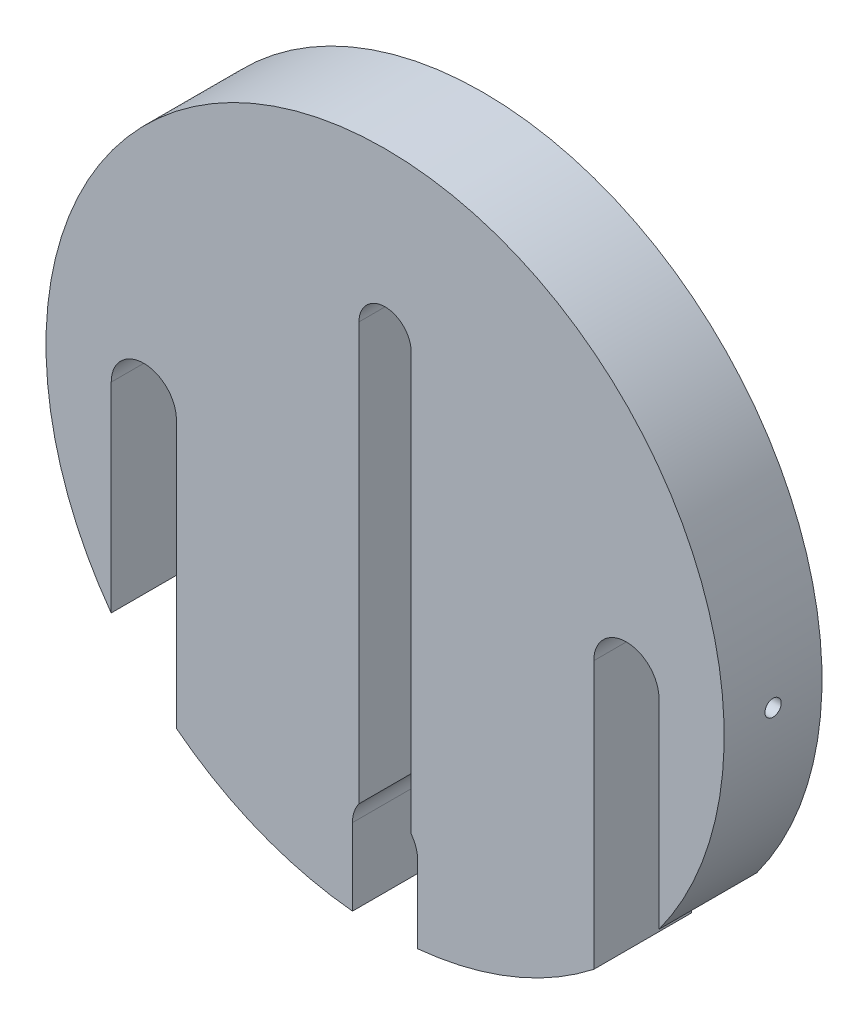
ISO-10303-21;
HEADER;
FILE_DESCRIPTION(('STEP AP214'),'2;1');
FILE_NAME('part.step','',(''),(''),'','','');
FILE_SCHEMA(('AUTOMOTIVE_DESIGN { 1 0 10303 214 1 1 1 1 }'));
ENDSEC;
DATA;
#1=APPLICATION_CONTEXT('core data for automotive mechanical design processes');
#2=APPLICATION_PROTOCOL_DEFINITION('international standard','automotive_design',2000,#1);
#3=PRODUCT_CONTEXT('',#1,'mechanical');
#4=PRODUCT('Part','Part','',(#3));
#5=PRODUCT_RELATED_PRODUCT_CATEGORY('part','',(#4));
#6=PRODUCT_DEFINITION_FORMATION('','',#4);
#7=PRODUCT_DEFINITION_CONTEXT('part definition',#1,'design');
#8=PRODUCT_DEFINITION('design','',#6,#7);
#9=PRODUCT_DEFINITION_SHAPE('','',#8);
#10=(LENGTH_UNIT() NAMED_UNIT(*) SI_UNIT(.MILLI.,.METRE.));
#11=(NAMED_UNIT(*) PLANE_ANGLE_UNIT() SI_UNIT($,.RADIAN.));
#12=(NAMED_UNIT(*) SI_UNIT($,.STERADIAN.) SOLID_ANGLE_UNIT());
#13=UNCERTAINTY_MEASURE_WITH_UNIT(LENGTH_MEASURE(1.E-05),#10,'distance_accuracy_value','');
#14=(GEOMETRIC_REPRESENTATION_CONTEXT(3) GLOBAL_UNCERTAINTY_ASSIGNED_CONTEXT((#13)) GLOBAL_UNIT_ASSIGNED_CONTEXT((#10,
#11,#12)) REPRESENTATION_CONTEXT('',''));
#15=CARTESIAN_POINT('',(0.,0.,0.));
#16=DIRECTION('',(0.,0.,1.));
#17=DIRECTION('',(1.,0.,0.));
#18=AXIS2_PLACEMENT_3D('',#15,#16,#17);
#19=CARTESIAN_POINT('',(0.,0.,15.));
#20=DIRECTION('',(0.,0.,1.));
#21=DIRECTION('',(1.,0.,0.));
#22=AXIS2_PLACEMENT_3D('',#19,#20,#21);
#23=PLANE('',#22);
#24=CARTESIAN_POINT('',(0.,27.,15.));
#25=DIRECTION('',(0.,0.,-1.));
#26=DIRECTION('',(-1.,0.,0.));
#27=AXIS2_PLACEMENT_3D('',#24,#25,#26);
#28=CIRCLE('',#27,4.00000000000005);
#29=CARTESIAN_POINT('',(-4.00000000000004,27.,15.));
#30=VERTEX_POINT('',#29);
#31=CARTESIAN_POINT('',(4.,27.000000608153,15.));
#32=VERTEX_POINT('',#31);
#33=EDGE_CURVE('E411',#30,#32,#28,.T.);
#34=ORIENTED_EDGE('',*,*,#33,.T.);
#35=DIRECTION('',(0.,-1.,0.));
#36=VECTOR('',#35,1.);
#37=CARTESIAN_POINT('',(4.,27.000000608153,15.));
#38=LINE('',#37,#36);
#39=CARTESIAN_POINT('',(4.00000000000001,-37.,15.));
#40=VERTEX_POINT('',#39);
#41=EDGE_CURVE('E410',#32,#40,#38,.T.);
#42=ORIENTED_EDGE('',*,*,#41,.T.);
#43=CARTESIAN_POINT('',(0.,-40.,15.));
#44=DIRECTION('',(0.,0.,1.));
#45=DIRECTION('',(1.,0.,0.));
#46=AXIS2_PLACEMENT_3D('',#43,#44,#45);
#47=CIRCLE('',#46,5.00000000000001);
#48=CARTESIAN_POINT('',(5.00000000000001,-40.,15.));
#49=VERTEX_POINT('',#48);
#50=EDGE_CURVE('E221',#49,#40,#47,.T.);
#51=ORIENTED_EDGE('',*,*,#50,.F.);
#52=DIRECTION('',(0.,1.,0.));
#53=VECTOR('',#52,1.);
#54=CARTESIAN_POINT('',(5.00000000000001,-40.,15.));
#55=LINE('',#54,#53);
#56=CARTESIAN_POINT('',(5.,-51.7590571784301,15.));
#57=VERTEX_POINT('',#56);
#58=EDGE_CURVE('E217',#57,#49,#55,.T.);
#59=ORIENTED_EDGE('',*,*,#58,.F.);
#60=CARTESIAN_POINT('',(0.,0.,15.));
#61=DIRECTION('',(0.,0.,1.));
#62=DIRECTION('',(1.,0.,0.));
#63=AXIS2_PLACEMENT_3D('',#60,#61,#62);
#64=CIRCLE('',#63,52.);
#65=CARTESIAN_POINT('',(32.,-40.9878030638384,15.));
#66=VERTEX_POINT('',#65);
#67=EDGE_CURVE('E251',#57,#66,#64,.T.);
#68=ORIENTED_EDGE('',*,*,#67,.T.);
#69=DIRECTION('',(0.,-1.,0.));
#70=VECTOR('',#69,1.);
#71=CARTESIAN_POINT('',(32.,0.,15.));
#72=LINE('',#71,#70);
#73=CARTESIAN_POINT('',(32.,0.,15.));
#74=VERTEX_POINT('',#73);
#75=EDGE_CURVE('E383',#74,#66,#72,.T.);
#76=ORIENTED_EDGE('',*,*,#75,.F.);
#77=CARTESIAN_POINT('',(37.,0.,15.));
#78=DIRECTION('',(0.,0.,1.));
#79=DIRECTION('',(-1.,0.,0.));
#80=AXIS2_PLACEMENT_3D('',#77,#78,#79);
#81=CIRCLE('',#80,5.00000000000001);
#82=CARTESIAN_POINT('',(42.,3.54103706807145E-07,15.));
#83=VERTEX_POINT('',#82);
#84=EDGE_CURVE('E388',#83,#74,#81,.T.);
#85=ORIENTED_EDGE('',*,*,#84,.F.);
#86=DIRECTION('',(0.,1.,0.));
#87=VECTOR('',#86,1.);
#88=CARTESIAN_POINT('',(42.,3.54103707564824E-07,15.));
#89=LINE('',#88,#87);
#90=CARTESIAN_POINT('',(42.,-30.6594194335118,15.));
#91=VERTEX_POINT('',#90);
#92=EDGE_CURVE('E205',#91,#83,#89,.T.);
#93=ORIENTED_EDGE('',*,*,#92,.F.);
#94=CARTESIAN_POINT('',(-42.,-30.6594194335118,15.));
#95=VERTEX_POINT('',#94);
#96=EDGE_CURVE('E248',#91,#95,#64,.T.);
#97=ORIENTED_EDGE('',*,*,#96,.T.);
#98=DIRECTION('',(0.,-1.,0.));
#99=VECTOR('',#98,1.);
#100=CARTESIAN_POINT('',(-42.,3.54103707564824E-07,15.));
#101=LINE('',#100,#99);
#102=CARTESIAN_POINT('',(-42.,3.54103707564824E-07,15.));
#103=VERTEX_POINT('',#102);
#104=EDGE_CURVE('E198',#103,#95,#101,.T.);
#105=ORIENTED_EDGE('',*,*,#104,.F.);
#106=CARTESIAN_POINT('',(-37.,0.,15.));
#107=DIRECTION('',(0.,0.,1.));
#108=DIRECTION('',(1.,0.,0.));
#109=AXIS2_PLACEMENT_3D('',#106,#107,#108);
#110=CIRCLE('',#109,5.00000000000001);
#111=CARTESIAN_POINT('',(-32.,0.,15.));
#112=VERTEX_POINT('',#111);
#113=EDGE_CURVE('E195',#112,#103,#110,.T.);
#114=ORIENTED_EDGE('',*,*,#113,.F.);
#115=DIRECTION('',(0.,1.,0.));
#116=VECTOR('',#115,1.);
#117=CARTESIAN_POINT('',(-32.,0.,15.));
#118=LINE('',#117,#116);
#119=CARTESIAN_POINT('',(-32.,-40.9878030638384,15.));
#120=VERTEX_POINT('',#119);
#121=EDGE_CURVE('E191',#120,#112,#118,.T.);
#122=ORIENTED_EDGE('',*,*,#121,.F.);
#123=CARTESIAN_POINT('',(-5.,-51.7590571784301,15.));
#124=VERTEX_POINT('',#123);
#125=EDGE_CURVE('E253',#120,#124,#64,.T.);
#126=ORIENTED_EDGE('',*,*,#125,.T.);
#127=DIRECTION('',(0.,-1.,0.));
#128=VECTOR('',#127,1.);
#129=CARTESIAN_POINT('',(-5.,-39.9999996458963,15.));
#130=LINE('',#129,#128);
#131=CARTESIAN_POINT('',(-5.,-39.9999996458963,15.));
#132=VERTEX_POINT('',#131);
#133=EDGE_CURVE('E224',#132,#124,#130,.T.);
#134=ORIENTED_EDGE('',*,*,#133,.F.);
#135=CARTESIAN_POINT('',(-4.,-37.,15.));
#136=VERTEX_POINT('',#135);
#137=EDGE_CURVE('E219',#136,#132,#47,.T.);
#138=ORIENTED_EDGE('',*,*,#137,.F.);
#139=DIRECTION('',(0.,-1.,0.));
#140=VECTOR('',#139,1.);
#141=CARTESIAN_POINT('',(-4.00000000000004,27.,15.));
#142=LINE('',#141,#140);
#143=EDGE_CURVE('E371',#30,#136,#142,.T.);
#144=ORIENTED_EDGE('',*,*,#143,.F.);
#145=EDGE_LOOP('',(#34,#42,#51,#59,#68,#76,#85,#93,#97,#105,#114,#122,#126,#134,#138,#144));
#146=FACE_BOUND('',#145,.T.);
#147=ADVANCED_FACE('F36',(#146),#23,.T.);
#148=CARTESIAN_POINT('',(0.,0.,0.));
#149=DIRECTION('',(0.,0.,1.));
#150=DIRECTION('',(1.,0.,0.));
#151=AXIS2_PLACEMENT_3D('',#148,#149,#150);
#152=PLANE('',#151);
#153=DIRECTION('',(0.,-1.,0.));
#154=VECTOR('',#153,1.);
#155=CARTESIAN_POINT('',(4.,0.,0.));
#156=LINE('',#155,#154);
#157=CARTESIAN_POINT('',(4.,27.000000608153,0.));
#158=VERTEX_POINT('',#157);
#159=CARTESIAN_POINT('',(4.00000000000001,-37.,0.));
#160=VERTEX_POINT('',#159);
#161=EDGE_CURVE('E220',#158,#160,#156,.T.);
#162=ORIENTED_EDGE('',*,*,#161,.F.);
#163=CARTESIAN_POINT('',(0.,27.,0.));
#164=DIRECTION('',(0.,0.,1.));
#165=DIRECTION('',(1.,0.,0.));
#166=AXIS2_PLACEMENT_3D('',#163,#164,#165);
#167=CIRCLE('',#166,4.00000000000005);
#168=CARTESIAN_POINT('',(-4.00000000000004,27.,0.));
#169=VERTEX_POINT('',#168);
#170=EDGE_CURVE('E270',#169,#158,#167,.F.);
#171=ORIENTED_EDGE('',*,*,#170,.F.);
#172=DIRECTION('',(0.,-1.,0.));
#173=VECTOR('',#172,1.);
#174=CARTESIAN_POINT('',(-4.00000000000002,0.,0.));
#175=LINE('',#174,#173);
#176=CARTESIAN_POINT('',(-4.,-37.,0.));
#177=VERTEX_POINT('',#176);
#178=EDGE_CURVE('E402',#169,#177,#175,.T.);
#179=ORIENTED_EDGE('',*,*,#178,.T.);
#180=CARTESIAN_POINT('',(0.,-40.,0.));
#181=DIRECTION('',(0.,0.,1.));
#182=DIRECTION('',(1.,0.,0.));
#183=AXIS2_PLACEMENT_3D('',#180,#181,#182);
#184=CIRCLE('',#183,5.00000000000001);
#185=CARTESIAN_POINT('',(-5.,-39.9999996458963,0.));
#186=VERTEX_POINT('',#185);
#187=EDGE_CURVE('E213',#177,#186,#184,.T.);
#188=ORIENTED_EDGE('',*,*,#187,.T.);
#189=DIRECTION('',(0.,-1.,0.));
#190=VECTOR('',#189,1.);
#191=CARTESIAN_POINT('',(-5.,-39.9999996458963,0.));
#192=LINE('',#191,#190);
#193=CARTESIAN_POINT('',(-5.,-51.7590571784301,0.));
#194=VERTEX_POINT('',#193);
#195=EDGE_CURVE('E212',#186,#194,#192,.T.);
#196=ORIENTED_EDGE('',*,*,#195,.T.);
#197=CARTESIAN_POINT('',(0.,0.,0.));
#198=DIRECTION('',(0.,0.,1.));
#199=DIRECTION('',(1.,0.,0.));
#200=AXIS2_PLACEMENT_3D('',#197,#198,#199);
#201=CIRCLE('',#200,52.);
#202=CARTESIAN_POINT('',(-32.,-40.9878030638384,0.));
#203=VERTEX_POINT('',#202);
#204=EDGE_CURVE('E252',#203,#194,#201,.T.);
#205=ORIENTED_EDGE('',*,*,#204,.F.);
#206=DIRECTION('',(0.,1.,0.));
#207=VECTOR('',#206,1.);
#208=CARTESIAN_POINT('',(-32.,0.,0.));
#209=LINE('',#208,#207);
#210=CARTESIAN_POINT('',(-32.,0.,0.));
#211=VERTEX_POINT('',#210);
#212=EDGE_CURVE('E260',#203,#211,#209,.T.);
#213=ORIENTED_EDGE('',*,*,#212,.T.);
#214=CARTESIAN_POINT('',(-37.,0.,0.));
#215=DIRECTION('',(0.,0.,1.));
#216=DIRECTION('',(1.,0.,0.));
#217=AXIS2_PLACEMENT_3D('',#214,#215,#216);
#218=CIRCLE('',#217,5.00000000000001);
#219=CARTESIAN_POINT('',(-42.,3.54103707564824E-07,0.));
#220=VERTEX_POINT('',#219);
#221=EDGE_CURVE('E187',#211,#220,#218,.T.);
#222=ORIENTED_EDGE('',*,*,#221,.T.);
#223=DIRECTION('',(0.,-1.,0.));
#224=VECTOR('',#223,1.);
#225=CARTESIAN_POINT('',(-42.,3.54103707564824E-07,0.));
#226=LINE('',#225,#224);
#227=CARTESIAN_POINT('',(-42.,-30.6594194335118,0.));
#228=VERTEX_POINT('',#227);
#229=EDGE_CURVE('E190',#220,#228,#226,.T.);
#230=ORIENTED_EDGE('',*,*,#229,.T.);
#231=CARTESIAN_POINT('',(42.,-30.6594194335118,0.));
#232=VERTEX_POINT('',#231);
#233=EDGE_CURVE('E247',#232,#228,#201,.T.);
#234=ORIENTED_EDGE('',*,*,#233,.F.);
#235=DIRECTION('',(0.,1.,0.));
#236=VECTOR('',#235,1.);
#237=CARTESIAN_POINT('',(42.,0.,0.));
#238=LINE('',#237,#236);
#239=CARTESIAN_POINT('',(42.,3.54103706807145E-07,0.));
#240=VERTEX_POINT('',#239);
#241=EDGE_CURVE('E263',#232,#240,#238,.T.);
#242=ORIENTED_EDGE('',*,*,#241,.T.);
#243=CARTESIAN_POINT('',(37.,0.,0.));
#244=DIRECTION('',(0.,0.,1.));
#245=DIRECTION('',(-1.,0.,0.));
#246=AXIS2_PLACEMENT_3D('',#243,#244,#245);
#247=CIRCLE('',#246,5.00000000000001);
#248=CARTESIAN_POINT('',(32.,0.,0.));
#249=VERTEX_POINT('',#248);
#250=EDGE_CURVE('E178',#240,#249,#247,.T.);
#251=ORIENTED_EDGE('',*,*,#250,.T.);
#252=DIRECTION('',(0.,-1.,0.));
#253=VECTOR('',#252,1.);
#254=CARTESIAN_POINT('',(32.,0.,0.));
#255=LINE('',#254,#253);
#256=CARTESIAN_POINT('',(32.,-40.9878030638384,0.));
#257=VERTEX_POINT('',#256);
#258=EDGE_CURVE('E184',#249,#257,#255,.T.);
#259=ORIENTED_EDGE('',*,*,#258,.T.);
#260=CARTESIAN_POINT('',(5.,-51.7590571784301,0.));
#261=VERTEX_POINT('',#260);
#262=EDGE_CURVE('E256',#261,#257,#201,.T.);
#263=ORIENTED_EDGE('',*,*,#262,.F.);
#264=DIRECTION('',(0.,1.,0.));
#265=VECTOR('',#264,1.);
#266=CARTESIAN_POINT('',(5.00000000000005,0.,0.));
#267=LINE('',#266,#265);
#268=CARTESIAN_POINT('',(5.00000000000001,-40.,0.));
#269=VERTEX_POINT('',#268);
#270=EDGE_CURVE('E257',#261,#269,#267,.T.);
#271=ORIENTED_EDGE('',*,*,#270,.T.);
#272=EDGE_CURVE('E209',#269,#160,#184,.T.);
#273=ORIENTED_EDGE('',*,*,#272,.T.);
#274=EDGE_LOOP('',(#162,#171,#179,#188,#196,#205,#213,#222,#230,#234,#242,#251,#259,#263,#271,#273));
#275=FACE_BOUND('',#274,.T.);
#276=ADVANCED_FACE('F290',(#275),#152,.F.);
#277=CARTESIAN_POINT('',(0.,-40.,0.));
#278=DIRECTION('',(0.,0.,1.));
#279=DIRECTION('',(1.,0.,0.));
#280=AXIS2_PLACEMENT_3D('',#277,#278,#279);
#281=CYLINDRICAL_SURFACE('',#280,5.00000000000001);
#282=DIRECTION('',(0.,0.,1.));
#283=VECTOR('',#282,1.);
#284=CARTESIAN_POINT('',(4.00000000000001,-37.,0.));
#285=LINE('',#284,#283);
#286=EDGE_CURVE('E268',#160,#40,#285,.T.);
#287=ORIENTED_EDGE('',*,*,#286,.F.);
#288=ORIENTED_EDGE('',*,*,#272,.F.);
#289=DIRECTION('',(0.,0.,1.));
#290=VECTOR('',#289,1.);
#291=CARTESIAN_POINT('',(5.00000000000001,-40.,0.));
#292=LINE('',#291,#290);
#293=EDGE_CURVE('E216',#269,#49,#292,.T.);
#294=ORIENTED_EDGE('',*,*,#293,.T.);
#295=ORIENTED_EDGE('',*,*,#50,.T.);
#296=EDGE_LOOP('',(#287,#288,#294,#295));
#297=FACE_BOUND('',#296,.T.);
#298=ADVANCED_FACE('F349',(#297),#281,.F.);
#299=CARTESIAN_POINT('',(0.,0.,15.));
#300=DIRECTION('',(0.,0.,-1.));
#301=DIRECTION('',(-1.,0.,0.));
#302=AXIS2_PLACEMENT_3D('',#299,#300,#301);
#303=CYLINDRICAL_SURFACE('',#302,52.);
#304=CARTESIAN_POINT('',(52.,0.,6.25));
#305=CARTESIAN_POINT('',(51.9999997973088,-0.0702021682383052,6.25000311220363));
#306=CARTESIAN_POINT('',(51.9998563106322,-0.140454981299909,6.25593386660927));
#307=CARTESIAN_POINT('',(51.9992977076948,-0.279025061692463,6.27951009979809));
#308=CARTESIAN_POINT('',(51.9988822660898,-0.347339908342714,6.29716961025872));
#309=CARTESIAN_POINT('',(51.9978268063139,-0.480006518674068,6.34369966980517));
#310=CARTESIAN_POINT('',(51.9971868970909,-0.544360187175891,6.37256478085578));
#311=CARTESIAN_POINT('',(51.9957547048813,-0.667290326060267,6.44067898451166));
#312=CARTESIAN_POINT('',(51.994962459352,-0.725868211277511,6.47992552536564));
#313=CARTESIAN_POINT('',(51.9933145119984,-0.835622273193974,6.56770483640095));
#314=CARTESIAN_POINT('',(51.992458792151,-0.886796335352946,6.6162402503378));
#315=CARTESIAN_POINT('',(51.990780501975,-0.980272465512588,6.72121538076444));
#316=CARTESIAN_POINT('',(51.9899579329611,-1.02257418194791,6.77765541032568));
#317=CARTESIAN_POINT('',(51.9884386382574,-1.09710656749047,6.8968434905856));
#318=CARTESIAN_POINT('',(51.9877419254735,-1.12933620399878,6.9595921871836));
#319=CARTESIAN_POINT('',(51.9865530399832,-1.18280272821267,7.08961174165532));
#320=CARTESIAN_POINT('',(51.9860608666028,-1.20403965213251,7.15688258463052));
#321=CARTESIAN_POINT('',(51.9853366665823,-1.23491401602256,7.29402307537363));
#322=CARTESIAN_POINT('',(51.9851045894986,-1.24455370521054,7.36389221650566));
#323=CARTESIAN_POINT('',(51.9849265971695,-1.25196688375206,7.50425738102641));
#324=CARTESIAN_POINT('',(51.9849806810062,-1.24974041116973,7.5747534024035));
#325=CARTESIAN_POINT('',(51.985368864565,-1.23348639528717,7.71435593657015));
#326=CARTESIAN_POINT('',(51.9857029064413,-1.21946128985313,7.78346273338511));
#327=CARTESIAN_POINT('',(51.9866132572273,-1.18001189587483,7.91834067716101));
#328=CARTESIAN_POINT('',(51.9871895665711,-1.15458758690517,7.98411181814478));
#329=CARTESIAN_POINT('',(51.9885195494868,-1.09305869575102,8.11045924385023));
#330=CARTESIAN_POINT('',(51.9892732416252,-1.05695299544567,8.17103498386411));
#331=CARTESIAN_POINT('',(51.9908730034263,-0.975087078618902,8.28526608230648));
#332=CARTESIAN_POINT('',(51.9917190732111,-0.929326849329945,8.33892143158303));
#333=CARTESIAN_POINT('',(51.9934084671118,-0.829437040423046,8.43780288140086));
#334=CARTESIAN_POINT('',(51.9942517904784,-0.775305344685604,8.48302684428369));
#335=CARTESIAN_POINT('',(51.9958404130572,-0.660216686710964,8.56374531101953));
#336=CARTESIAN_POINT('',(51.9965857122549,-0.599259723452948,8.59923981341735));
#337=CARTESIAN_POINT('',(51.9978942734955,-0.472249722743773,8.65949153987308));
#338=CARTESIAN_POINT('',(51.998457534427,-0.40619665417872,8.6842486983688));
#339=CARTESIAN_POINT('',(51.9993385034976,-0.27087000044249,8.7223216062816));
#340=CARTESIAN_POINT('',(51.9996562120698,-0.201596420951345,8.73563737587711));
#341=CARTESIAN_POINT('',(52.0000102060239,-0.0618137651800235,8.75044690061213));
#342=CARTESIAN_POINT('',(52.0000465618082,0.00869499759668231,8.75194361321069));
#343=CARTESIAN_POINT('',(51.9998339381804,0.148962822072931,8.74308024207334));
#344=CARTESIAN_POINT('',(51.999584958976,0.218721884317889,8.73272016696394));
#345=CARTESIAN_POINT('',(51.9988297746627,0.355501843431972,8.70043975528012));
#346=CARTESIAN_POINT('',(51.9983235993952,0.422523056986941,8.67852075982413));
#347=CARTESIAN_POINT('',(51.9971110716701,0.551934524088054,8.62374607673541));
#348=CARTESIAN_POINT('',(51.9964047189633,0.614324771868786,8.5908903754871));
#349=CARTESIAN_POINT('',(51.9948712555013,0.732716877463098,8.51516732123365));
#350=CARTESIAN_POINT('',(51.9940441207374,0.788717461205737,8.47229797672667));
#351=CARTESIAN_POINT('',(51.9923624037812,0.892727786468902,8.37776747133739));
#352=CARTESIAN_POINT('',(51.9915078215399,0.940737513734256,8.32610629477137));
#353=CARTESIAN_POINT('',(51.9898673520108,1.02741314608396,8.21544594624026));
#354=CARTESIAN_POINT('',(51.9890814787735,1.06607714286236,8.15644527934256));
#355=CARTESIAN_POINT('',(51.9876672513446,1.13295071499423,8.03278844476162));
#356=CARTESIAN_POINT('',(51.9870388968654,1.16116030943127,7.96813228740223));
#357=CARTESIAN_POINT('',(51.986010651412,1.20632097468798,7.83500703297695));
#358=CARTESIAN_POINT('',(51.9856107352912,1.22327328474351,7.76653835650436));
#359=CARTESIAN_POINT('',(51.9850843844908,1.2454422349171,7.62772563951998));
#360=CARTESIAN_POINT('',(51.9849579498333,1.25065887408153,7.5573815988558));
#361=CARTESIAN_POINT('',(51.9849928263669,1.24920824130315,7.41683417053418));
#362=CARTESIAN_POINT('',(51.9851540645164,1.2425439859774,7.34663075170298));
#363=CARTESIAN_POINT('',(51.9857459562054,1.21752692509744,7.20833944412384));
#364=CARTESIAN_POINT('',(51.9861766102819,1.19917409623921,7.14025155959403));
#365=CARTESIAN_POINT('',(51.9872587771959,1.15130111652815,7.00812254258516));
#366=CARTESIAN_POINT('',(51.9879102939352,1.12178076839044,6.94408148162043));
#367=CARTESIAN_POINT('',(51.9893607072791,1.05241221955216,6.82186616244462));
#368=CARTESIAN_POINT('',(51.9901595983903,1.01256440379106,6.76369168567845));
#369=CARTESIAN_POINT('',(51.9918148782012,0.923664908008776,6.65484810987456));
#370=CARTESIAN_POINT('',(51.9926712753634,0.874611871432861,6.60418011902436));
#371=CARTESIAN_POINT('',(51.9943451604329,0.768681400797779,6.51178498268632));
#372=CARTESIAN_POINT('',(51.9951626386401,0.711802029727766,6.47006005715846));
#373=CARTESIAN_POINT('',(51.9966667561244,0.591815678316268,6.39673083564491));
#374=CARTESIAN_POINT('',(51.9973533183375,0.528705062911211,6.36513249328728));
#375=CARTESIAN_POINT('',(51.9985167523366,0.398121936425729,6.31301654483188));
#376=CARTESIAN_POINT('',(51.9989938745217,0.330654745279389,6.29248570008038));
#377=CARTESIAN_POINT('',(51.9995568847199,0.218966673914316,6.26853953100294));
#378=CARTESIAN_POINT('',(51.9997223338085,0.175471023124023,6.26159592793198));
#379=CARTESIAN_POINT('',(51.9999439549651,0.0879902146157654,6.25232518744696));
#380=CARTESIAN_POINT('',(52.0000001270536,0.0440050569896061,6.24999804916712));
#381=CARTESIAN_POINT('',(52.,0.,6.25));
#382=B_SPLINE_CURVE_WITH_KNOTS('',3,(#304,#305,#306,#307,#308,#309,#310,#311,#312,#313,#314,
#315,#316,#317,#318,#319,#320,#321,#322,#323,#324,#325,#326,#327,#328,#329,#330,#331,#332,#333,
#334,#335,#336,#337,#338,#339,#340,#341,#342,#343,#344,#345,#346,#347,#348,#349,#350,#351,#352,
#353,#354,#355,#356,#357,#358,#359,#360,#361,#362,#363,#364,#365,#366,#367,#368,#369,#370,#371,
#372,#373,#374,#375,#376,#377,#378,#379,#380,#381),.UNSPECIFIED.,.T.,.F.,(4,2,2,2,2,2,2,2,2,2,2,
2,2,2,2,2,2,2,2,2,2,2,2,2,2,2,2,2,2,2,2,2,2,2,2,2,2,2,4),(0.,0.210445882636134,
0.421143986447301,0.631739966839943,0.842284230848761,1.05288850833586,1.26350112940933,
1.47413533560462,1.68476884788466,1.89536150240307,2.10595348138537,2.31650195795435,
2.52705081179124,2.73762171354373,2.94819289376539,3.15881738893704,3.36944191561073,
3.58006772833867,3.79069316959878,4.00126590480426,4.21183848680563,4.42238664259345,
4.63293506050298,4.84352538774548,5.0541160906635,5.26474975786886,5.47538304057948,
5.68599313229698,5.89660324112857,6.10715988264211,6.31771694395336,6.52827772513008,
6.73883065912657,6.94941464628389,7.16005084685616,7.37081065859629,7.58131780232444,
7.71323231476464,7.84514680246529),.UNSPECIFIED.);
#383=CARTESIAN_POINT('',(52.,0.,6.25));
#384=VERTEX_POINT('',#383);
#385=EDGE_CURVE('E173',#384,#384,#382,.T.);
#386=ORIENTED_EDGE('',*,*,#385,.T.);
#387=EDGE_LOOP('',(#386));
#388=FACE_BOUND('',#387,.T.);
#389=CARTESIAN_POINT('',(-52.,0.,8.74999999999999));
#390=CARTESIAN_POINT('',(-51.9999997973088,-0.0702021682383054,8.74999688779635));
#391=CARTESIAN_POINT('',(-51.9998563106322,-0.14045498129991,8.74406613339072));
#392=CARTESIAN_POINT('',(-51.9992977076948,-0.279025061692464,8.7204899002019));
#393=CARTESIAN_POINT('',(-51.9988822660898,-0.347339908342714,8.70283038974126));
#394=CARTESIAN_POINT('',(-51.9978268063139,-0.480006518674068,8.65630033019482));
#395=CARTESIAN_POINT('',(-51.9971868970909,-0.544360187175891,8.62743521914421));
#396=CARTESIAN_POINT('',(-51.9957547048813,-0.667290326060267,8.55932101548832));
#397=CARTESIAN_POINT('',(-51.994962459352,-0.725868211277511,8.52007447463434));
#398=CARTESIAN_POINT('',(-51.9933145119984,-0.835622273193974,8.43229516359904));
#399=CARTESIAN_POINT('',(-51.992458792151,-0.886796335352947,8.38375974966219));
#400=CARTESIAN_POINT('',(-51.990780501975,-0.980272465512589,8.27878461923555));
#401=CARTESIAN_POINT('',(-51.9899579329611,-1.02257418194791,8.22234458967431));
#402=CARTESIAN_POINT('',(-51.9884386382574,-1.09710656749047,8.10315650941439));
#403=CARTESIAN_POINT('',(-51.9877419254735,-1.12933620399878,8.04040781281639));
#404=CARTESIAN_POINT('',(-51.9865530399832,-1.18280272821267,7.91038825834466));
#405=CARTESIAN_POINT('',(-51.9860608666028,-1.20403965213251,7.84311741536946));
#406=CARTESIAN_POINT('',(-51.9853366665823,-1.23491401602256,7.70597692462635));
#407=CARTESIAN_POINT('',(-51.9851045894986,-1.24455370521054,7.63610778349432));
#408=CARTESIAN_POINT('',(-51.9849265971695,-1.25196688375206,7.49574261897358));
#409=CARTESIAN_POINT('',(-51.9849806810062,-1.24974041116973,7.42524659759648));
#410=CARTESIAN_POINT('',(-51.985368864565,-1.23348639528717,7.28564406342984));
#411=CARTESIAN_POINT('',(-51.9857029064413,-1.21946128985313,7.21653726661487));
#412=CARTESIAN_POINT('',(-51.9866132572273,-1.18001189587483,7.08165932283898));
#413=CARTESIAN_POINT('',(-51.9871895665711,-1.15458758690517,7.0158881818552));
#414=CARTESIAN_POINT('',(-51.9885195494868,-1.09305869575102,6.88954075614975));
#415=CARTESIAN_POINT('',(-51.9892732416252,-1.05695299544567,6.82896501613588));
#416=CARTESIAN_POINT('',(-51.9908730034263,-0.975087078618901,6.71473391769351));
#417=CARTESIAN_POINT('',(-51.9917190732111,-0.929326849329944,6.66107856841696));
#418=CARTESIAN_POINT('',(-51.9934084671118,-0.829437040423045,6.56219711859913));
#419=CARTESIAN_POINT('',(-51.9942517904784,-0.775305344685603,6.5169731557163));
#420=CARTESIAN_POINT('',(-51.9958404130572,-0.660216686710963,6.43625468898046));
#421=CARTESIAN_POINT('',(-51.9965857122549,-0.599259723452947,6.40076018658263));
#422=CARTESIAN_POINT('',(-51.9978942734955,-0.472249722743772,6.34050846012691));
#423=CARTESIAN_POINT('',(-51.998457534427,-0.40619665417872,6.31575130163119));
#424=CARTESIAN_POINT('',(-51.9993385034976,-0.27087000044249,6.27767839371839));
#425=CARTESIAN_POINT('',(-51.9996562120698,-0.201596420951345,6.26436262412288));
#426=CARTESIAN_POINT('',(-52.0000102060239,-0.0618137651800236,6.24955309938786));
#427=CARTESIAN_POINT('',(-52.0000465618082,0.00869499759668254,6.24805638678929));
#428=CARTESIAN_POINT('',(-51.9998339381804,0.148962822072932,6.25691975792665));
#429=CARTESIAN_POINT('',(-51.999584958976,0.21872188431789,6.26727983303604));
#430=CARTESIAN_POINT('',(-51.9988297746627,0.355501843431973,6.29956024471986));
#431=CARTESIAN_POINT('',(-51.9983235993952,0.422523056986942,6.32147924017586));
#432=CARTESIAN_POINT('',(-51.9971110716701,0.551934524088055,6.37625392326458));
#433=CARTESIAN_POINT('',(-51.9964047189633,0.614324771868787,6.40910962451289));
#434=CARTESIAN_POINT('',(-51.9948712555013,0.732716877463099,6.48483267876633));
#435=CARTESIAN_POINT('',(-51.9940441207374,0.788717461205738,6.52770202327332));
#436=CARTESIAN_POINT('',(-51.9923624037812,0.892727786468903,6.6222325286626));
#437=CARTESIAN_POINT('',(-51.9915078215399,0.940737513734257,6.67389370522862));
#438=CARTESIAN_POINT('',(-51.9898673520108,1.02741314608396,6.78455405375973));
#439=CARTESIAN_POINT('',(-51.9890814787735,1.06607714286236,6.84355472065743));
#440=CARTESIAN_POINT('',(-51.9876672513446,1.13295071499423,6.96721155523837));
#441=CARTESIAN_POINT('',(-51.9870388968654,1.16116030943127,7.03186771259776));
#442=CARTESIAN_POINT('',(-51.986010651412,1.20632097468798,7.16499296702304));
#443=CARTESIAN_POINT('',(-51.9856107352912,1.22327328474351,7.23346164349563));
#444=CARTESIAN_POINT('',(-51.9850843844908,1.2454422349171,7.37227436048001));
#445=CARTESIAN_POINT('',(-51.9849579498333,1.25065887408153,7.44261840114419));
#446=CARTESIAN_POINT('',(-51.9849928263669,1.24920824130315,7.5831658294658));
#447=CARTESIAN_POINT('',(-51.9851540645164,1.2425439859774,7.65336924829701));
#448=CARTESIAN_POINT('',(-51.9857459562054,1.21752692509744,7.79166055587615));
#449=CARTESIAN_POINT('',(-51.9861766102819,1.19917409623921,7.85974844040596));
#450=CARTESIAN_POINT('',(-51.9872587771959,1.15130111652815,7.99187745741483));
#451=CARTESIAN_POINT('',(-51.9879102939352,1.12178076839044,8.05591851837956));
#452=CARTESIAN_POINT('',(-51.9893607072791,1.05241221955216,8.17813383755537));
#453=CARTESIAN_POINT('',(-51.9901595983903,1.01256440379105,8.23630831432154));
#454=CARTESIAN_POINT('',(-51.9918148782012,0.923664908008775,8.34515189012543));
#455=CARTESIAN_POINT('',(-51.9926712753634,0.874611871432859,8.39581988097564));
#456=CARTESIAN_POINT('',(-51.9943451604329,0.768681400797777,8.48821501731367));
#457=CARTESIAN_POINT('',(-51.9951626386401,0.711802029727764,8.52993994284153));
#458=CARTESIAN_POINT('',(-51.9966667561244,0.591815678316265,8.60326916435508));
#459=CARTESIAN_POINT('',(-51.9973533183375,0.528705062911209,8.63486750671271));
#460=CARTESIAN_POINT('',(-51.9985167523366,0.398121936425727,8.68698345516811));
#461=CARTESIAN_POINT('',(-51.9989938745217,0.330654745279387,8.70751429991961));
#462=CARTESIAN_POINT('',(-51.9995568847199,0.218966673914315,8.73146046899705));
#463=CARTESIAN_POINT('',(-51.9997223338085,0.175471023124022,8.738404072068));
#464=CARTESIAN_POINT('',(-51.9999439549651,0.0879902146157652,8.74767481255302));
#465=CARTESIAN_POINT('',(-52.0000001270536,0.0440050569896061,8.75000195083287));
#466=CARTESIAN_POINT('',(-52.,0.,8.74999999999999));
#467=B_SPLINE_CURVE_WITH_KNOTS('',3,(#389,#390,#391,#392,#393,#394,#395,#396,#397,#398,#399,
#400,#401,#402,#403,#404,#405,#406,#407,#408,#409,#410,#411,#412,#413,#414,#415,#416,#417,#418,
#419,#420,#421,#422,#423,#424,#425,#426,#427,#428,#429,#430,#431,#432,#433,#434,#435,#436,#437,
#438,#439,#440,#441,#442,#443,#444,#445,#446,#447,#448,#449,#450,#451,#452,#453,#454,#455,#456,
#457,#458,#459,#460,#461,#462,#463,#464,#465,#466),.UNSPECIFIED.,.T.,.F.,(4,2,2,2,2,2,2,2,2,2,2,
2,2,2,2,2,2,2,2,2,2,2,2,2,2,2,2,2,2,2,2,2,2,2,2,2,2,2,4),(0.,0.210445882636135,
0.421143986447301,0.631739966839943,0.842284230848761,1.05288850833586,1.26350112940933,
1.47413533560462,1.68476884788466,1.89536150240307,2.10595348138537,2.31650195795435,
2.52705081179124,2.73762171354373,2.94819289376539,3.15881738893704,3.36944191561073,
3.58006772833867,3.79069316959878,4.00126590480426,4.21183848680563,4.42238664259345,
4.63293506050298,4.84352538774548,5.0541160906635,5.26474975786886,5.47538304057948,
5.68599313229698,5.89660324112857,6.10715988264211,6.31771694395336,6.52827772513008,
6.73883065912657,6.94941464628389,7.16005084685616,7.37081065859629,7.58131780232444,
7.71323231476464,7.84514680246529),.UNSPECIFIED.);
#468=CARTESIAN_POINT('',(-52.,0.,8.74999999999999));
#469=VERTEX_POINT('',#468);
#470=EDGE_CURVE('E294',#469,#469,#467,.T.);
#471=ORIENTED_EDGE('',*,*,#470,.T.);
#472=EDGE_LOOP('',(#471));
#473=FACE_BOUND('',#472,.T.);
#474=ORIENTED_EDGE('',*,*,#96,.F.);
#475=DIRECTION('',(0.,0.,-1.));
#476=VECTOR('',#475,1.);
#477=CARTESIAN_POINT('',(42.,-30.6594194335118,15.));
#478=LINE('',#477,#476);
#479=EDGE_CURVE('E244',#91,#232,#478,.T.);
#480=ORIENTED_EDGE('',*,*,#479,.T.);
#481=ORIENTED_EDGE('',*,*,#233,.T.);
#482=DIRECTION('',(0.,0.,-1.));
#483=VECTOR('',#482,1.);
#484=CARTESIAN_POINT('',(-42.,-30.6594194335118,15.));
#485=LINE('',#484,#483);
#486=EDGE_CURVE('E235',#228,#95,#485,.F.);
#487=ORIENTED_EDGE('',*,*,#486,.T.);
#488=EDGE_LOOP('',(#474,#480,#481,#487));
#489=FACE_BOUND('',#488,.T.);
#490=ADVANCED_FACE('F289',(#388,#473,#489),#303,.T.);
#491=ORIENTED_EDGE('',*,*,#125,.F.);
#492=DIRECTION('',(0.,0.,-1.));
#493=VECTOR('',#492,1.);
#494=CARTESIAN_POINT('',(-32.,-40.9878030638384,15.));
#495=LINE('',#494,#493);
#496=EDGE_CURVE('E238',#120,#203,#495,.T.);
#497=ORIENTED_EDGE('',*,*,#496,.T.);
#498=ORIENTED_EDGE('',*,*,#204,.T.);
#499=DIRECTION('',(0.,0.,-1.));
#500=VECTOR('',#499,1.);
#501=CARTESIAN_POINT('',(-5.,-51.7590571784301,15.));
#502=LINE('',#501,#500);
#503=EDGE_CURVE('E182',#194,#124,#502,.F.);
#504=ORIENTED_EDGE('',*,*,#503,.T.);
#505=EDGE_LOOP('',(#491,#497,#498,#504));
#506=FACE_BOUND('',#505,.T.);
#507=ADVANCED_FACE('F287',(#506),#303,.T.);
#508=ORIENTED_EDGE('',*,*,#262,.T.);
#509=DIRECTION('',(0.,0.,-1.));
#510=VECTOR('',#509,1.);
#511=CARTESIAN_POINT('',(32.,-40.9878030638384,15.));
#512=LINE('',#511,#510);
#513=EDGE_CURVE('E241',#257,#66,#512,.F.);
#514=ORIENTED_EDGE('',*,*,#513,.T.);
#515=ORIENTED_EDGE('',*,*,#67,.F.);
#516=DIRECTION('',(0.,0.,-1.));
#517=VECTOR('',#516,1.);
#518=CARTESIAN_POINT('',(5.,-51.7590571784301,15.));
#519=LINE('',#518,#517);
#520=EDGE_CURVE('E232',#57,#261,#519,.T.);
#521=ORIENTED_EDGE('',*,*,#520,.T.);
#522=EDGE_LOOP('',(#508,#514,#515,#521));
#523=FACE_BOUND('',#522,.T.);
#524=ADVANCED_FACE('F282',(#523),#303,.T.);
#525=CARTESIAN_POINT('',(5.00000000000001,-40.,0.));
#526=DIRECTION('',(1.,0.,0.));
#527=DIRECTION('',(0.,1.,0.));
#528=AXIS2_PLACEMENT_3D('',#525,#526,#527);
#529=PLANE('',#528);
#530=ORIENTED_EDGE('',*,*,#58,.T.);
#531=ORIENTED_EDGE('',*,*,#293,.F.);
#532=ORIENTED_EDGE('',*,*,#270,.F.);
#533=ORIENTED_EDGE('',*,*,#520,.F.);
#534=EDGE_LOOP('',(#530,#531,#532,#533));
#535=FACE_BOUND('',#534,.T.);
#536=ADVANCED_FACE('F286',(#535),#529,.F.);
#537=CARTESIAN_POINT('',(-5.,-39.9999996458963,0.));
#538=DIRECTION('',(-1.,0.,0.));
#539=DIRECTION('',(0.,0.,1.));
#540=AXIS2_PLACEMENT_3D('',#537,#538,#539);
#541=PLANE('',#540);
#542=ORIENTED_EDGE('',*,*,#195,.F.);
#543=DIRECTION('',(0.,0.,1.));
#544=VECTOR('',#543,1.);
#545=CARTESIAN_POINT('',(-5.,-39.9999996458963,0.));
#546=LINE('',#545,#544);
#547=EDGE_CURVE('E199',#186,#132,#546,.T.);
#548=ORIENTED_EDGE('',*,*,#547,.T.);
#549=ORIENTED_EDGE('',*,*,#133,.T.);
#550=ORIENTED_EDGE('',*,*,#503,.F.);
#551=EDGE_LOOP('',(#542,#548,#549,#550));
#552=FACE_BOUND('',#551,.T.);
#553=ADVANCED_FACE('F355',(#552),#541,.F.);
#554=ORIENTED_EDGE('',*,*,#187,.F.);
#555=DIRECTION('',(0.,0.,1.));
#556=VECTOR('',#555,1.);
#557=CARTESIAN_POINT('',(-4.,-37.,0.));
#558=LINE('',#557,#556);
#559=EDGE_CURVE('E265',#177,#136,#558,.T.);
#560=ORIENTED_EDGE('',*,*,#559,.T.);
#561=ORIENTED_EDGE('',*,*,#137,.T.);
#562=ORIENTED_EDGE('',*,*,#547,.F.);
#563=EDGE_LOOP('',(#554,#560,#561,#562));
#564=FACE_BOUND('',#563,.T.);
#565=ADVANCED_FACE('F336',(#564),#281,.F.);
#566=CARTESIAN_POINT('',(-32.,0.,0.));
#567=DIRECTION('',(1.,0.,0.));
#568=DIRECTION('',(0.,1.,0.));
#569=AXIS2_PLACEMENT_3D('',#566,#567,#568);
#570=PLANE('',#569);
#571=ORIENTED_EDGE('',*,*,#121,.T.);
#572=DIRECTION('',(0.,0.,1.));
#573=VECTOR('',#572,1.);
#574=CARTESIAN_POINT('',(-32.,0.,0.));
#575=LINE('',#574,#573);
#576=EDGE_CURVE('E202',#211,#112,#575,.T.);
#577=ORIENTED_EDGE('',*,*,#576,.F.);
#578=ORIENTED_EDGE('',*,*,#212,.F.);
#579=ORIENTED_EDGE('',*,*,#496,.F.);
#580=EDGE_LOOP('',(#571,#577,#578,#579));
#581=FACE_BOUND('',#580,.T.);
#582=ADVANCED_FACE('F333',(#581),#570,.F.);
#583=CARTESIAN_POINT('',(-42.,3.54103707564824E-07,0.));
#584=DIRECTION('',(-1.,0.,0.));
#585=DIRECTION('',(0.,-1.,0.));
#586=AXIS2_PLACEMENT_3D('',#583,#584,#585);
#587=PLANE('',#586);
#588=DIRECTION('',(0.,0.,1.));
#589=VECTOR('',#588,1.);
#590=CARTESIAN_POINT('',(-42.,3.54103707564824E-07,0.));
#591=LINE('',#590,#589);
#592=CARTESIAN_POINT('',(-42.,3.54103707564824E-07,6.25000000000004));
#593=VERTEX_POINT('',#592);
#594=EDGE_CURVE('E206',#220,#593,#591,.T.);
#595=ORIENTED_EDGE('',*,*,#594,.T.);
#596=CARTESIAN_POINT('',(-42.,4.2084060287746E-08,7.49999999999999));
#597=DIRECTION('',(-1.,0.,0.));
#598=DIRECTION('',(0.,-1.,0.));
#599=AXIS2_PLACEMENT_3D('',#596,#597,#598);
#600=CIRCLE('',#599,1.24999999999999);
#601=CARTESIAN_POINT('',(-42.,4.2084060287746E-08,8.74999999999999));
#602=VERTEX_POINT('',#601);
#603=EDGE_CURVE('E61',#593,#602,#600,.T.);
#604=ORIENTED_EDGE('',*,*,#603,.T.);
#605=EDGE_CURVE('E194',#602,#103,#591,.T.);
#606=ORIENTED_EDGE('',*,*,#605,.T.);
#607=ORIENTED_EDGE('',*,*,#104,.T.);
#608=ORIENTED_EDGE('',*,*,#486,.F.);
#609=ORIENTED_EDGE('',*,*,#229,.F.);
#610=EDGE_LOOP('',(#595,#604,#606,#607,#608,#609));
#611=FACE_BOUND('',#610,.T.);
#612=ADVANCED_FACE('F335',(#611),#587,.F.);
#613=CARTESIAN_POINT('',(-37.,0.,0.));
#614=DIRECTION('',(0.,0.,1.));
#615=DIRECTION('',(1.,0.,0.));
#616=AXIS2_PLACEMENT_3D('',#613,#614,#615);
#617=CYLINDRICAL_SURFACE('',#616,5.00000000000001);
#618=ORIENTED_EDGE('',*,*,#605,.F.);
#619=CARTESIAN_POINT('',(-42.,3.54103706807145E-07,8.74999999999995));
#620=CARTESIAN_POINT('',(-42.0000019698079,0.0345962109535075,8.75000036733156));
#621=CARTESIAN_POINT('',(-41.9996404936215,0.0691749906174984,8.74856281630385));
#622=CARTESIAN_POINT('',(-41.9982116469028,0.13807504465332,8.74283186489602));
#623=CARTESIAN_POINT('',(-41.9971443861555,0.172396358234505,8.73853890867465));
#624=CARTESIAN_POINT('',(-41.9929230926666,0.274465490628713,8.72143803970292));
#625=CARTESIAN_POINT('',(-41.9887493158175,0.341513597152897,8.70440786460434));
#626=CARTESIAN_POINT('',(-41.978130887403,0.47168933793925,8.65963551965459));
#627=CARTESIAN_POINT('',(-41.9716863212688,0.534817119585975,8.63189375278891));
#628=CARTESIAN_POINT('',(-41.9572127078016,0.655545888709279,8.56652297495877));
#629=CARTESIAN_POINT('',(-41.9491832927455,0.713145588919877,8.528891668711));
#630=CARTESIAN_POINT('',(-41.9322287279025,0.822334036468348,8.4440006736609));
#631=CARTESIAN_POINT('',(-41.9232898451054,0.873793088213536,8.39657697586146));
#632=CARTESIAN_POINT('',(-41.9056140979806,0.968120937953429,8.2937937025666));
#633=CARTESIAN_POINT('',(-41.8968772717376,1.01098812799001,8.23843264492165));
#634=CARTESIAN_POINT('',(-41.8804562054093,1.08752338434268,8.12033548268722));
#635=CARTESIAN_POINT('',(-41.8727895156136,1.12104544860962,8.05750209881624));
#636=CARTESIAN_POINT('',(-41.8595787984925,1.17699872136717,7.92687251514339));
#637=CARTESIAN_POINT('',(-41.8540343229407,1.19943227212025,7.8590773669076));
#638=CARTESIAN_POINT('',(-41.8458373264214,1.23212895222211,7.72188086047806));
#639=CARTESIAN_POINT('',(-41.8431291319247,1.2426267370769,7.65253882903115));
#640=CARTESIAN_POINT('',(-41.8407446692873,1.25188488376058,7.51302745336922));
#641=CARTESIAN_POINT('',(-41.8410679762969,1.25064689029974,7.44285822645807));
#642=CARTESIAN_POINT('',(-41.8446600558508,1.23665539946916,7.30548620116503));
#643=CARTESIAN_POINT('',(-41.8478572271655,1.22418181684245,7.23825272836033));
#644=CARTESIAN_POINT('',(-41.8567226457766,1.18851988414104,7.1068649094225));
#645=CARTESIAN_POINT('',(-41.8623910469806,1.16533086670568,7.04271075534507));
#646=CARTESIAN_POINT('',(-41.8756260519871,1.10865747445152,6.91855063735618));
#647=CARTESIAN_POINT('',(-41.883211268713,1.07507137564504,6.8585931734794));
#648=CARTESIAN_POINT('',(-41.8994144909958,0.998628999899663,6.74506621549333));
#649=CARTESIAN_POINT('',(-41.9080326529542,0.9557713183281,6.69149769120975));
#650=CARTESIAN_POINT('',(-41.9256313634183,0.860558382936344,6.59066923562111));
#651=CARTESIAN_POINT('',(-41.9346152513619,0.807967894552481,6.54363176833578));
#652=CARTESIAN_POINT('',(-41.9517145571499,0.695522349652299,6.45899061633023));
#653=CARTESIAN_POINT('',(-41.9598297512869,0.635665430300447,6.42138935830385));
#654=CARTESIAN_POINT('',(-41.9743191433029,0.510059578723901,6.35660377999585));
#655=CARTESIAN_POINT('',(-41.98068631416,0.44428823652223,6.32946133258996));
#656=CARTESIAN_POINT('',(-41.9909041651273,0.308960316263613,6.28671468368123));
#657=CARTESIAN_POINT('',(-41.9947585300604,0.239409443577937,6.27109358263516));
#658=CARTESIAN_POINT('',(-41.9980897271397,0.141048299958117,6.25765943940913));
#659=CARTESIAN_POINT('',(-41.998805126935,0.112896288349569,6.25478660091017));
#660=CARTESIAN_POINT('',(-41.9997600026167,0.056500753190994,6.2509590657878));
#661=CARTESIAN_POINT('',(-42.0000002609954,0.0282574569546838,6.25000121541455));
#662=CARTESIAN_POINT('',(-42.,3.54103707972836E-07,6.25000000000003));
#663=B_SPLINE_CURVE_WITH_KNOTS('',3,(#619,#620,#621,#622,#623,#624,#625,#626,#627,#628,#629,
#630,#631,#632,#633,#634,#635,#636,#637,#638,#639,#640,#641,#642,#643,#644,#645,#646,#647,#648,
#649,#650,#651,#652,#653,#654,#655,#656,#657,#658,#659,#660,#661,#662),.UNSPECIFIED.,.F.,.F.,(4,
2,2,2,2,2,2,2,2,2,2,2,2,2,2,2,2,2,2,2,2,4),(0.,0.103722197945735,0.207428265658936,
0.414262737219717,0.621089428128321,0.827964164323008,1.03863503900278,1.2493453037821,
1.46318344658796,1.67697640034946,1.8864893131438,2.09597286419212,2.30037760176206,
2.50479507143991,2.71127937071114,2.91779497401812,3.13017769073769,3.34261496971653,
3.55589413782676,3.76885984188613,3.85372633239662,3.93845294272702),.UNSPECIFIED.);
#664=EDGE_CURVE('E49',#602,#593,#663,.T.);
#665=ORIENTED_EDGE('',*,*,#664,.T.);
#666=ORIENTED_EDGE('',*,*,#594,.F.);
#667=ORIENTED_EDGE('',*,*,#221,.F.);
#668=ORIENTED_EDGE('',*,*,#576,.T.);
#669=ORIENTED_EDGE('',*,*,#113,.T.);
#670=EDGE_LOOP('',(#618,#665,#666,#667,#668,#669));
#671=FACE_BOUND('',#670,.T.);
#672=ADVANCED_FACE('F276',(#671),#617,.F.);
#673=CARTESIAN_POINT('',(42.,3.54103707564824E-07,0.));
#674=DIRECTION('',(1.,0.,0.));
#675=DIRECTION('',(0.,1.,0.));
#676=AXIS2_PLACEMENT_3D('',#673,#674,#675);
#677=PLANE('',#676);
#678=DIRECTION('',(0.,0.,1.));
#679=VECTOR('',#678,1.);
#680=CARTESIAN_POINT('',(42.,3.54103706807145E-07,0.));
#681=LINE('',#680,#679);
#682=CARTESIAN_POINT('',(42.,3.54103706807145E-07,8.74999999999995));
#683=VERTEX_POINT('',#682);
#684=EDGE_CURVE('E172',#683,#83,#681,.T.);
#685=ORIENTED_EDGE('',*,*,#684,.F.);
#686=CARTESIAN_POINT('',(42.,4.2084060287746E-08,7.49999999999999));
#687=DIRECTION('',(1.,0.,0.));
#688=DIRECTION('',(0.,1.,0.));
#689=AXIS2_PLACEMENT_3D('',#686,#687,#688);
#690=CIRCLE('',#689,1.24999999999999);
#691=CARTESIAN_POINT('',(42.,4.2084060287746E-08,6.25));
#692=VERTEX_POINT('',#691);
#693=EDGE_CURVE('E55',#683,#692,#690,.T.);
#694=ORIENTED_EDGE('',*,*,#693,.T.);
#695=EDGE_CURVE('E169',#240,#692,#681,.T.);
#696=ORIENTED_EDGE('',*,*,#695,.F.);
#697=ORIENTED_EDGE('',*,*,#241,.F.);
#698=ORIENTED_EDGE('',*,*,#479,.F.);
#699=ORIENTED_EDGE('',*,*,#92,.T.);
#700=EDGE_LOOP('',(#685,#694,#696,#697,#698,#699));
#701=FACE_BOUND('',#700,.T.);
#702=ADVANCED_FACE('F168',(#701),#677,.F.);
#703=CARTESIAN_POINT('',(32.,0.,0.));
#704=DIRECTION('',(-1.,0.,0.));
#705=DIRECTION('',(0.,-1.,0.));
#706=AXIS2_PLACEMENT_3D('',#703,#704,#705);
#707=PLANE('',#706);
#708=ORIENTED_EDGE('',*,*,#258,.F.);
#709=DIRECTION('',(0.,0.,1.));
#710=VECTOR('',#709,1.);
#711=CARTESIAN_POINT('',(32.,0.,0.));
#712=LINE('',#711,#710);
#713=EDGE_CURVE('E180',#249,#74,#712,.T.);
#714=ORIENTED_EDGE('',*,*,#713,.T.);
#715=ORIENTED_EDGE('',*,*,#75,.T.);
#716=ORIENTED_EDGE('',*,*,#513,.F.);
#717=EDGE_LOOP('',(#708,#714,#715,#716));
#718=FACE_BOUND('',#717,.T.);
#719=ADVANCED_FACE('F325',(#718),#707,.F.);
#720=CARTESIAN_POINT('',(37.,0.,0.));
#721=DIRECTION('',(0.,0.,1.));
#722=DIRECTION('',(1.,0.,0.));
#723=AXIS2_PLACEMENT_3D('',#720,#721,#722);
#724=CYLINDRICAL_SURFACE('',#723,5.00000000000001);
#725=ORIENTED_EDGE('',*,*,#695,.T.);
#726=CARTESIAN_POINT('',(42.,3.54103706807145E-07,6.25000000000004));
#727=CARTESIAN_POINT('',(42.0000019698079,0.0345962109535075,6.24999963266842));
#728=CARTESIAN_POINT('',(41.9996404936215,0.0691749906174985,6.25143718369614));
#729=CARTESIAN_POINT('',(41.9982116469028,0.138075044653321,6.25716813510396));
#730=CARTESIAN_POINT('',(41.9971443861555,0.172396358234505,6.26146109132534));
#731=CARTESIAN_POINT('',(41.9929230926666,0.274465490628713,6.27856196029707));
#732=CARTESIAN_POINT('',(41.9887493158175,0.341513597152897,6.29559213539565));
#733=CARTESIAN_POINT('',(41.978130887403,0.47168933793925,6.34036448034539));
#734=CARTESIAN_POINT('',(41.9716863212688,0.534817119585975,6.36810624721107));
#735=CARTESIAN_POINT('',(41.9572127078016,0.655545888709278,6.43347702504122));
#736=CARTESIAN_POINT('',(41.9491832927455,0.713145588919876,6.47110833128899));
#737=CARTESIAN_POINT('',(41.9322287279025,0.822334036468347,6.55599932633909));
#738=CARTESIAN_POINT('',(41.9232898451054,0.873793088213535,6.60342302413853));
#739=CARTESIAN_POINT('',(41.9056140979806,0.968120937953428,6.70620629743339));
#740=CARTESIAN_POINT('',(41.8968772717376,1.01098812799001,6.76156735507834));
#741=CARTESIAN_POINT('',(41.8804562054093,1.08752338434268,6.87966451731277));
#742=CARTESIAN_POINT('',(41.8727895156136,1.12104544860962,6.94249790118375));
#743=CARTESIAN_POINT('',(41.8595787984925,1.17699872136717,7.0731274848566));
#744=CARTESIAN_POINT('',(41.8540343229407,1.19943227212025,7.14092263309239));
#745=CARTESIAN_POINT('',(41.8458373264214,1.23212895222211,7.27811913952193));
#746=CARTESIAN_POINT('',(41.8431291319247,1.2426267370769,7.34746117096884));
#747=CARTESIAN_POINT('',(41.8407446692873,1.25188488376058,7.48697254663077));
#748=CARTESIAN_POINT('',(41.8410679762969,1.25064689029974,7.55714177354191));
#749=CARTESIAN_POINT('',(41.8446600558508,1.23665539946916,7.69451379883496));
#750=CARTESIAN_POINT('',(41.8478572271655,1.22418181684245,7.76174727163966));
#751=CARTESIAN_POINT('',(41.8567226457766,1.18851988414104,7.89313509057749));
#752=CARTESIAN_POINT('',(41.8623910469806,1.16533086670568,7.95728924465491));
#753=CARTESIAN_POINT('',(41.8756260519871,1.10865747445152,8.0814493626438));
#754=CARTESIAN_POINT('',(41.883211268713,1.07507137564504,8.14140682652059));
#755=CARTESIAN_POINT('',(41.8994144909958,0.998628999899663,8.25493378450666));
#756=CARTESIAN_POINT('',(41.9080326529542,0.9557713183281,8.30850230879024));
#757=CARTESIAN_POINT('',(41.9256313634183,0.860558382936343,8.40933076437888));
#758=CARTESIAN_POINT('',(41.9346152513619,0.807967894552481,8.45636823166421));
#759=CARTESIAN_POINT('',(41.9517145571499,0.695522349652299,8.54100938366975));
#760=CARTESIAN_POINT('',(41.9598297512869,0.635665430300448,8.57861064169613));
#761=CARTESIAN_POINT('',(41.9743191433029,0.510059578723902,8.64339622000414));
#762=CARTESIAN_POINT('',(41.98068631416,0.444288236522232,8.67053866741002));
#763=CARTESIAN_POINT('',(41.9909041651273,0.308960316263614,8.71328531631876));
#764=CARTESIAN_POINT('',(41.9947585300604,0.239409443577938,8.72890641736483));
#765=CARTESIAN_POINT('',(41.9980897271397,0.141048299958117,8.74234056059085));
#766=CARTESIAN_POINT('',(41.998805126935,0.11289628834957,8.74521339908982));
#767=CARTESIAN_POINT('',(41.9997600026167,0.0565007531909945,8.74904093421219));
#768=CARTESIAN_POINT('',(42.0000002609954,0.0282574569546842,8.74999878458544));
#769=CARTESIAN_POINT('',(42.,3.54103708026198E-07,8.74999999999996));
#770=B_SPLINE_CURVE_WITH_KNOTS('',3,(#726,#727,#728,#729,#730,#731,#732,#733,#734,#735,#736,
#737,#738,#739,#740,#741,#742,#743,#744,#745,#746,#747,#748,#749,#750,#751,#752,#753,#754,#755,
#756,#757,#758,#759,#760,#761,#762,#763,#764,#765,#766,#767,#768,#769),.UNSPECIFIED.,.F.,.F.,(4,
2,2,2,2,2,2,2,2,2,2,2,2,2,2,2,2,2,2,2,2,4),(0.,0.103722197945736,0.207428265658936,
0.414262737219717,0.62108942812832,0.827964164323007,1.03863503900278,1.2493453037821,
1.46318344658795,1.67697640034946,1.8864893131438,2.09597286419212,2.30037760176206,
2.50479507143991,2.71127937071114,2.91779497401812,3.13017769073769,3.34261496971653,
3.55589413782676,3.76885984188612,3.85372633239662,3.93845294272702),.UNSPECIFIED.);
#771=EDGE_CURVE('E11',#692,#683,#770,.T.);
#772=ORIENTED_EDGE('',*,*,#771,.T.);
#773=ORIENTED_EDGE('',*,*,#684,.T.);
#774=ORIENTED_EDGE('',*,*,#84,.T.);
#775=ORIENTED_EDGE('',*,*,#713,.F.);
#776=ORIENTED_EDGE('',*,*,#250,.F.);
#777=EDGE_LOOP('',(#725,#772,#773,#774,#775,#776));
#778=FACE_BOUND('',#777,.T.);
#779=ADVANCED_FACE('F175',(#778),#724,.F.);
#780=CARTESIAN_POINT('',(0.,27.,-15.));
#781=DIRECTION('',(0.,0.,1.));
#782=DIRECTION('',(1.,0.,0.));
#783=AXIS2_PLACEMENT_3D('',#780,#781,#782);
#784=CYLINDRICAL_SURFACE('',#783,4.00000000000005);
#785=ORIENTED_EDGE('',*,*,#170,.T.);
#786=DIRECTION('',(0.,0.,1.));
#787=VECTOR('',#786,1.);
#788=CARTESIAN_POINT('',(4.,27.000000608153,-15.));
#789=LINE('',#788,#787);
#790=EDGE_CURVE('E403',#158,#32,#789,.T.);
#791=ORIENTED_EDGE('',*,*,#790,.T.);
#792=ORIENTED_EDGE('',*,*,#33,.F.);
#793=DIRECTION('',(0.,0.,1.));
#794=VECTOR('',#793,1.);
#795=CARTESIAN_POINT('',(-4.00000000000004,27.,-15.));
#796=LINE('',#795,#794);
#797=EDGE_CURVE('E407',#169,#30,#796,.T.);
#798=ORIENTED_EDGE('',*,*,#797,.F.);
#799=EDGE_LOOP('',(#785,#791,#792,#798));
#800=FACE_BOUND('',#799,.T.);
#801=ADVANCED_FACE('F320',(#800),#784,.F.);
#802=CARTESIAN_POINT('',(4.,27.000000608153,-15.));
#803=DIRECTION('',(-1.,0.,0.));
#804=DIRECTION('',(0.,-1.,0.));
#805=AXIS2_PLACEMENT_3D('',#802,#803,#804);
#806=PLANE('',#805);
#807=ORIENTED_EDGE('',*,*,#161,.T.);
#808=ORIENTED_EDGE('',*,*,#286,.T.);
#809=ORIENTED_EDGE('',*,*,#41,.F.);
#810=ORIENTED_EDGE('',*,*,#790,.F.);
#811=EDGE_LOOP('',(#807,#808,#809,#810));
#812=FACE_BOUND('',#811,.T.);
#813=ADVANCED_FACE('F316',(#812),#806,.T.);
#814=CARTESIAN_POINT('',(-4.00000000000004,27.,-15.));
#815=DIRECTION('',(-1.,0.,0.));
#816=DIRECTION('',(0.,-1.,0.));
#817=AXIS2_PLACEMENT_3D('',#814,#815,#816);
#818=PLANE('',#817);
#819=ORIENTED_EDGE('',*,*,#797,.T.);
#820=ORIENTED_EDGE('',*,*,#143,.T.);
#821=ORIENTED_EDGE('',*,*,#559,.F.);
#822=ORIENTED_EDGE('',*,*,#178,.F.);
#823=EDGE_LOOP('',(#819,#820,#821,#822));
#824=FACE_BOUND('',#823,.T.);
#825=ADVANCED_FACE('F313',(#824),#818,.F.);
#826=CARTESIAN_POINT('',(-52.,4.2084060287746E-08,7.49999999999999));
#827=DIRECTION('',(-1.,0.,0.));
#828=DIRECTION('',(0.,0.,1.));
#829=AXIS2_PLACEMENT_3D('',#826,#827,#828);
#830=CYLINDRICAL_SURFACE('',#829,1.24999999999999);
#831=ORIENTED_EDGE('',*,*,#664,.F.);
#832=ORIENTED_EDGE('',*,*,#603,.F.);
#833=EDGE_LOOP('',(#831,#832));
#834=FACE_BOUND('',#833,.T.);
#835=ORIENTED_EDGE('',*,*,#470,.F.);
#836=EDGE_LOOP('',(#835));
#837=FACE_BOUND('',#836,.T.);
#838=ADVANCED_FACE('F309',(#834,#837),#830,.F.);
#839=CARTESIAN_POINT('',(52.,4.2084060287746E-08,7.49999999999999));
#840=DIRECTION('',(1.,0.,0.));
#841=DIRECTION('',(0.,0.,-1.));
#842=AXIS2_PLACEMENT_3D('',#839,#840,#841);
#843=CYLINDRICAL_SURFACE('',#842,1.24999999999999);
#844=ORIENTED_EDGE('',*,*,#771,.F.);
#845=ORIENTED_EDGE('',*,*,#693,.F.);
#846=EDGE_LOOP('',(#844,#845));
#847=FACE_BOUND('',#846,.T.);
#848=ORIENTED_EDGE('',*,*,#385,.F.);
#849=EDGE_LOOP('',(#848));
#850=FACE_BOUND('',#849,.T.);
#851=ADVANCED_FACE('F162',(#847,#850),#843,.F.);
#852=CLOSED_SHELL('',(#147,#276,#298,#490,#507,#524,#536,#553,#565,#582,#612,#672,#702,#719,
#779,#801,#813,#825,#838,#851));
#853=MANIFOLD_SOLID_BREP('B2',#852);
#854=ADVANCED_BREP_SHAPE_REPRESENTATION('',(#18,#853),#14);
#855=SHAPE_DEFINITION_REPRESENTATION(#9,#854);
ENDSEC;
END-ISO-10303-21;
